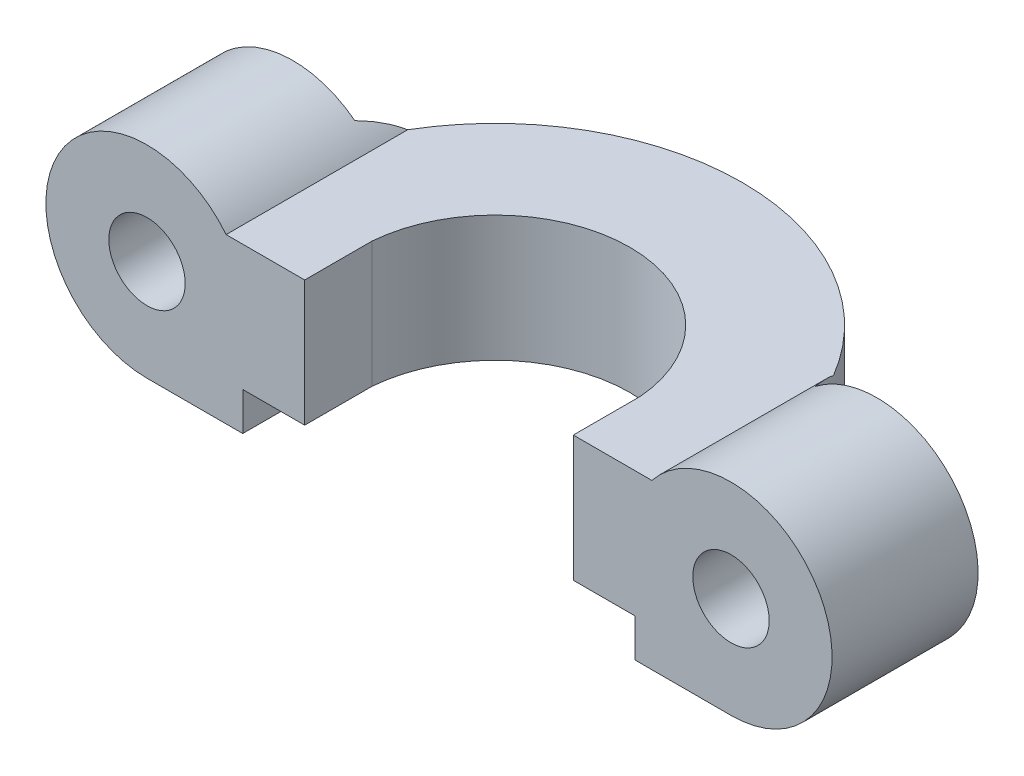
ISO-10303-21;
HEADER;
FILE_DESCRIPTION(('STEP AP214'),'2;1');
FILE_NAME('part.step','',(''),(''),'','','');
FILE_SCHEMA(('AUTOMOTIVE_DESIGN { 1 0 10303 214 1 1 1 1 }'));
ENDSEC;
DATA;
#1=APPLICATION_CONTEXT('core data for automotive mechanical design processes');
#2=APPLICATION_PROTOCOL_DEFINITION('international standard','automotive_design',2000,#1);
#3=PRODUCT_CONTEXT('',#1,'mechanical');
#4=PRODUCT('Part','Part','',(#3));
#5=PRODUCT_RELATED_PRODUCT_CATEGORY('part','',(#4));
#6=PRODUCT_DEFINITION_FORMATION('','',#4);
#7=PRODUCT_DEFINITION_CONTEXT('part definition',#1,'design');
#8=PRODUCT_DEFINITION('design','',#6,#7);
#9=PRODUCT_DEFINITION_SHAPE('','',#8);
#10=(LENGTH_UNIT() NAMED_UNIT(*) SI_UNIT(.MILLI.,.METRE.));
#11=(NAMED_UNIT(*) PLANE_ANGLE_UNIT() SI_UNIT($,.RADIAN.));
#12=(NAMED_UNIT(*) SI_UNIT($,.STERADIAN.) SOLID_ANGLE_UNIT());
#13=UNCERTAINTY_MEASURE_WITH_UNIT(LENGTH_MEASURE(1.E-05),#10,'distance_accuracy_value','');
#14=(GEOMETRIC_REPRESENTATION_CONTEXT(3) GLOBAL_UNCERTAINTY_ASSIGNED_CONTEXT((#13)) GLOBAL_UNIT_ASSIGNED_CONTEXT((#10,
#11,#12)) REPRESENTATION_CONTEXT('',''));
#15=CARTESIAN_POINT('',(0.,0.,0.));
#16=DIRECTION('',(0.,0.,1.));
#17=DIRECTION('',(1.,0.,0.));
#18=AXIS2_PLACEMENT_3D('',#15,#16,#17);
#19=CARTESIAN_POINT('',(0.,-7.5,-4.));
#20=DIRECTION('',(0.,0.,-1.));
#21=DIRECTION('',(-1.,0.,0.));
#22=AXIS2_PLACEMENT_3D('',#19,#20,#21);
#23=PLANE('',#22);
#24=CARTESIAN_POINT('',(-13.,0.,-4.));
#25=DIRECTION('',(0.,0.,-1.));
#26=DIRECTION('',(-1.,0.,0.));
#27=AXIS2_PLACEMENT_3D('',#24,#25,#26);
#28=CIRCLE('',#27,1.69999999999999);
#29=CARTESIAN_POINT('',(-14.7,0.,-4.));
#30=VERTEX_POINT('',#29);
#31=EDGE_CURVE('E276',#30,#30,#28,.F.);
#32=ORIENTED_EDGE('',*,*,#31,.T.);
#33=EDGE_LOOP('',(#32));
#34=FACE_BOUND('',#33,.T.);
#35=DIRECTION('',(0.,1.,0.));
#36=VECTOR('',#35,1.);
#37=CARTESIAN_POINT('',(-10.2469507659596,-7.5,-4.));
#38=LINE('',#37,#36);
#39=CARTESIAN_POINT('',(-10.2469507659596,-4.5,-4.));
#40=VERTEX_POINT('',#39);
#41=CARTESIAN_POINT('',(-10.2469507659596,3.559595470689,-4.));
#42=VERTEX_POINT('',#41);
#43=EDGE_CURVE('E279',#40,#42,#38,.T.);
#44=ORIENTED_EDGE('',*,*,#43,.F.);
#45=DIRECTION('',(-1.,0.,0.));
#46=VECTOR('',#45,1.);
#47=CARTESIAN_POINT('',(0.,-4.5,-4.));
#48=LINE('',#47,#46);
#49=CARTESIAN_POINT('',(-13.,-4.5,-4.));
#50=VERTEX_POINT('',#49);
#51=EDGE_CURVE('E46',#40,#50,#48,.T.);
#52=ORIENTED_EDGE('',*,*,#51,.T.);
#53=CARTESIAN_POINT('',(-13.,0.,-4.));
#54=DIRECTION('',(0.,0.,-1.));
#55=DIRECTION('',(-1.,0.,0.));
#56=AXIS2_PLACEMENT_3D('',#53,#54,#55);
#57=CIRCLE('',#56,4.5);
#58=EDGE_CURVE('E93',#50,#42,#57,.T.);
#59=ORIENTED_EDGE('',*,*,#58,.T.);
#60=EDGE_LOOP('',(#44,#52,#59));
#61=FACE_BOUND('',#60,.T.);
#62=ADVANCED_FACE('F42',(#34,#61),#23,.T.);
#63=CARTESIAN_POINT('',(13.,0.,-12.));
#64=DIRECTION('',(0.,0.,-1.));
#65=DIRECTION('',(-1.,0.,0.));
#66=AXIS2_PLACEMENT_3D('',#63,#64,#65);
#67=CYLINDRICAL_SURFACE('',#66,1.69999999999999);
#68=CARTESIAN_POINT('',(13.,0.,-4.));
#69=DIRECTION('',(0.,0.,-1.));
#70=DIRECTION('',(-1.,0.,0.));
#71=AXIS2_PLACEMENT_3D('',#68,#69,#70);
#72=CIRCLE('',#71,1.69999999999999);
#73=CARTESIAN_POINT('',(11.3,0.,-4.));
#74=VERTEX_POINT('',#73);
#75=EDGE_CURVE('E196',#74,#74,#72,.F.);
#76=ORIENTED_EDGE('',*,*,#75,.F.);
#77=EDGE_LOOP('',(#76));
#78=FACE_BOUND('',#77,.T.);
#79=CARTESIAN_POINT('',(13.,0.,2.5));
#80=DIRECTION('',(0.,0.,1.));
#81=DIRECTION('',(1.,0.,0.));
#82=AXIS2_PLACEMENT_3D('',#79,#80,#81);
#83=CIRCLE('',#82,1.7);
#84=CARTESIAN_POINT('',(14.7,0.,2.5));
#85=VERTEX_POINT('',#84);
#86=EDGE_CURVE('E409',#85,#85,#83,.T.);
#87=ORIENTED_EDGE('',*,*,#86,.T.);
#88=EDGE_LOOP('',(#87));
#89=FACE_BOUND('',#88,.T.);
#90=ADVANCED_FACE('F248',(#78,#89),#67,.F.);
#91=CARTESIAN_POINT('',(-13.,0.,-12.));
#92=DIRECTION('',(0.,0.,-1.));
#93=DIRECTION('',(-1.,0.,0.));
#94=AXIS2_PLACEMENT_3D('',#91,#92,#93);
#95=CYLINDRICAL_SURFACE('',#94,1.69999999999999);
#96=ORIENTED_EDGE('',*,*,#31,.F.);
#97=EDGE_LOOP('',(#96));
#98=FACE_BOUND('',#97,.T.);
#99=CARTESIAN_POINT('',(-13.,0.,2.5));
#100=DIRECTION('',(0.,0.,1.));
#101=DIRECTION('',(1.,0.,0.));
#102=AXIS2_PLACEMENT_3D('',#99,#100,#101);
#103=CIRCLE('',#102,1.7);
#104=CARTESIAN_POINT('',(-11.3,0.,2.5));
#105=VERTEX_POINT('',#104);
#106=EDGE_CURVE('E341',#105,#105,#103,.F.);
#107=ORIENTED_EDGE('',*,*,#106,.F.);
#108=EDGE_LOOP('',(#107));
#109=FACE_BOUND('',#108,.T.);
#110=ADVANCED_FACE('F253',(#98,#109),#95,.F.);
#111=CARTESIAN_POINT('',(8.75,2.8,0.));
#112=DIRECTION('',(0.,1.,0.));
#113=DIRECTION('',(0.,0.,1.));
#114=AXIS2_PLACEMENT_3D('',#111,#112,#113);
#115=PLANE('',#114);
#116=CARTESIAN_POINT('',(0.,2.8,0.));
#117=DIRECTION('',(0.,1.,0.));
#118=DIRECTION('',(0.,0.,1.));
#119=AXIS2_PLACEMENT_3D('',#116,#117,#118);
#120=CIRCLE('',#119,6.);
#121=CARTESIAN_POINT('',(5.9791303715507,2.8,-0.5));
#122=VERTEX_POINT('',#121);
#123=CARTESIAN_POINT('',(-5.9791303715507,2.8,-0.5));
#124=VERTEX_POINT('',#123);
#125=EDGE_CURVE('E129',#122,#124,#120,.T.);
#126=ORIENTED_EDGE('',*,*,#125,.F.);
#127=DIRECTION('',(0.,0.,-1.));
#128=VECTOR('',#127,1.);
#129=CARTESIAN_POINT('',(5.9791303715507,2.8,2.5));
#130=LINE('',#129,#128);
#131=CARTESIAN_POINT('',(5.9791303715507,2.8,2.5));
#132=VERTEX_POINT('',#131);
#133=EDGE_CURVE('E302',#132,#122,#130,.T.);
#134=ORIENTED_EDGE('',*,*,#133,.F.);
#135=DIRECTION('',(-1.,0.,0.));
#136=VECTOR('',#135,1.);
#137=CARTESIAN_POINT('',(0.,2.8,2.5));
#138=LINE('',#137,#136);
#139=CARTESIAN_POINT('',(9.47721700923829,2.8,2.5));
#140=VERTEX_POINT('',#139);
#141=EDGE_CURVE('E300',#140,#132,#138,.T.);
#142=ORIENTED_EDGE('',*,*,#141,.F.);
#143=DIRECTION('',(0.,0.,1.));
#144=VECTOR('',#143,1.);
#145=CARTESIAN_POINT('',(9.47721700923829,2.8,-11.));
#146=LINE('',#145,#144);
#147=CARTESIAN_POINT('',(9.47721700923829,2.8,-5.58411656037054));
#148=VERTEX_POINT('',#147);
#149=EDGE_CURVE('E183',#148,#140,#146,.T.);
#150=ORIENTED_EDGE('',*,*,#149,.F.);
#151=CARTESIAN_POINT('',(0.,2.8,0.));
#152=DIRECTION('',(0.,-1.,0.));
#153=DIRECTION('',(0.,0.,-1.));
#154=AXIS2_PLACEMENT_3D('',#151,#152,#153);
#155=CIRCLE('',#154,11.);
#156=CARTESIAN_POINT('',(-9.47721700923828,2.8,-5.58411656037054));
#157=VERTEX_POINT('',#156);
#158=EDGE_CURVE('E103',#148,#157,#155,.F.);
#159=ORIENTED_EDGE('',*,*,#158,.T.);
#160=DIRECTION('',(0.,0.,1.));
#161=VECTOR('',#160,1.);
#162=CARTESIAN_POINT('',(-9.47721700923828,2.8,-11.));
#163=LINE('',#162,#161);
#164=CARTESIAN_POINT('',(-9.47721700923828,2.8,2.5));
#165=VERTEX_POINT('',#164);
#166=EDGE_CURVE('E180',#157,#165,#163,.T.);
#167=ORIENTED_EDGE('',*,*,#166,.T.);
#168=DIRECTION('',(-1.,0.,0.));
#169=VECTOR('',#168,1.);
#170=CARTESIAN_POINT('',(0.,2.8,2.5));
#171=LINE('',#170,#169);
#172=CARTESIAN_POINT('',(-5.9791303715507,2.8,2.5));
#173=VERTEX_POINT('',#172);
#174=EDGE_CURVE('E158',#173,#165,#171,.T.);
#175=ORIENTED_EDGE('',*,*,#174,.F.);
#176=DIRECTION('',(0.,0.,-1.));
#177=VECTOR('',#176,1.);
#178=CARTESIAN_POINT('',(-5.9791303715507,2.8,2.5));
#179=LINE('',#178,#177);
#180=EDGE_CURVE('E149',#173,#124,#179,.T.);
#181=ORIENTED_EDGE('',*,*,#180,.T.);
#182=EDGE_LOOP('',(#126,#134,#142,#150,#159,#167,#175,#181));
#183=FACE_BOUND('',#182,.T.);
#184=ADVANCED_FACE('F156',(#183),#115,.T.);
#185=CARTESIAN_POINT('',(0.,7.5,0.));
#186=DIRECTION('',(0.,1.,0.));
#187=DIRECTION('',(0.,0.,1.));
#188=AXIS2_PLACEMENT_3D('',#185,#186,#187);
#189=CYLINDRICAL_SURFACE('',#188,6.);
#190=DIRECTION('',(0.,1.,0.));
#191=VECTOR('',#190,1.);
#192=CARTESIAN_POINT('',(-5.9791303715507,7.5,-0.5));
#193=LINE('',#192,#191);
#194=CARTESIAN_POINT('',(-5.9791303715507,-2.8,-0.5));
#195=VERTEX_POINT('',#194);
#196=EDGE_CURVE('E132',#195,#124,#193,.T.);
#197=ORIENTED_EDGE('',*,*,#196,.F.);
#198=CARTESIAN_POINT('',(0.,-2.8,0.));
#199=DIRECTION('',(0.,1.,0.));
#200=DIRECTION('',(0.,0.,1.));
#201=AXIS2_PLACEMENT_3D('',#198,#199,#200);
#202=CIRCLE('',#201,6.);
#203=CARTESIAN_POINT('',(5.9791303715507,-2.8,-0.5));
#204=VERTEX_POINT('',#203);
#205=EDGE_CURVE('E141',#204,#195,#202,.T.);
#206=ORIENTED_EDGE('',*,*,#205,.F.);
#207=DIRECTION('',(0.,1.,0.));
#208=VECTOR('',#207,1.);
#209=CARTESIAN_POINT('',(5.9791303715507,7.5,-0.5));
#210=LINE('',#209,#208);
#211=EDGE_CURVE('E135',#122,#204,#210,.F.);
#212=ORIENTED_EDGE('',*,*,#211,.F.);
#213=ORIENTED_EDGE('',*,*,#125,.T.);
#214=EDGE_LOOP('',(#197,#206,#212,#213));
#215=FACE_BOUND('',#214,.T.);
#216=ADVANCED_FACE('F131',(#215),#189,.F.);
#217=CARTESIAN_POINT('',(6.,-2.8,0.));
#218=DIRECTION('',(0.,-1.,0.));
#219=DIRECTION('',(0.,0.,-1.));
#220=AXIS2_PLACEMENT_3D('',#217,#218,#219);
#221=PLANE('',#220);
#222=ORIENTED_EDGE('',*,*,#205,.T.);
#223=DIRECTION('',(0.,0.,-1.));
#224=VECTOR('',#223,1.);
#225=CARTESIAN_POINT('',(-5.9791303715507,-2.8,2.5));
#226=LINE('',#225,#224);
#227=CARTESIAN_POINT('',(-5.9791303715507,-2.8,2.5));
#228=VERTEX_POINT('',#227);
#229=EDGE_CURVE('E152',#228,#195,#226,.T.);
#230=ORIENTED_EDGE('',*,*,#229,.F.);
#231=DIRECTION('',(1.,0.,0.));
#232=VECTOR('',#231,1.);
#233=CARTESIAN_POINT('',(0.,-2.8,2.5));
#234=LINE('',#233,#232);
#235=CARTESIAN_POINT('',(-8.73570260482807,-2.8,2.5));
#236=VERTEX_POINT('',#235);
#237=EDGE_CURVE('E357',#236,#228,#234,.T.);
#238=ORIENTED_EDGE('',*,*,#237,.F.);
#239=DIRECTION('',(0.,0.,-1.));
#240=VECTOR('',#239,1.);
#241=CARTESIAN_POINT('',(-8.73570260482807,-2.8,2.5));
#242=LINE('',#241,#240);
#243=CARTESIAN_POINT('',(-8.73570260482807,-2.8,-0.5));
#244=VERTEX_POINT('',#243);
#245=EDGE_CURVE('E163',#236,#244,#242,.T.);
#246=ORIENTED_EDGE('',*,*,#245,.T.);
#247=CARTESIAN_POINT('',(0.,-2.8,0.));
#248=DIRECTION('',(0.,1.,0.));
#249=DIRECTION('',(0.,0.,1.));
#250=AXIS2_PLACEMENT_3D('',#247,#248,#249);
#251=CIRCLE('',#250,8.75);
#252=CARTESIAN_POINT('',(8.73570260482807,-2.8,-0.5));
#253=VERTEX_POINT('',#252);
#254=EDGE_CURVE('E154',#253,#244,#251,.T.);
#255=ORIENTED_EDGE('',*,*,#254,.F.);
#256=DIRECTION('',(0.,0.,-1.));
#257=VECTOR('',#256,1.);
#258=CARTESIAN_POINT('',(8.73570260482807,-2.8,2.5));
#259=LINE('',#258,#257);
#260=CARTESIAN_POINT('',(8.73570260482807,-2.8,2.5));
#261=VERTEX_POINT('',#260);
#262=EDGE_CURVE('E332',#261,#253,#259,.T.);
#263=ORIENTED_EDGE('',*,*,#262,.F.);
#264=DIRECTION('',(1.,0.,0.));
#265=VECTOR('',#264,1.);
#266=CARTESIAN_POINT('',(0.,-2.8,2.5));
#267=LINE('',#266,#265);
#268=CARTESIAN_POINT('',(5.9791303715507,-2.8,2.5));
#269=VERTEX_POINT('',#268);
#270=EDGE_CURVE('E316',#269,#261,#267,.T.);
#271=ORIENTED_EDGE('',*,*,#270,.F.);
#272=DIRECTION('',(0.,0.,-1.));
#273=VECTOR('',#272,1.);
#274=CARTESIAN_POINT('',(5.9791303715507,-2.8,2.5));
#275=LINE('',#274,#273);
#276=EDGE_CURVE('E336',#269,#204,#275,.T.);
#277=ORIENTED_EDGE('',*,*,#276,.T.);
#278=EDGE_LOOP('',(#222,#230,#238,#246,#255,#263,#271,#277));
#279=FACE_BOUND('',#278,.T.);
#280=ADVANCED_FACE('F266',(#279),#221,.T.);
#281=CARTESIAN_POINT('',(0.,7.5,0.));
#282=DIRECTION('',(0.,1.,0.));
#283=DIRECTION('',(0.,0.,1.));
#284=AXIS2_PLACEMENT_3D('',#281,#282,#283);
#285=CYLINDRICAL_SURFACE('',#284,8.75);
#286=DIRECTION('',(0.,1.,0.));
#287=VECTOR('',#286,1.);
#288=CARTESIAN_POINT('',(-8.73570260482807,7.5,-0.5));
#289=LINE('',#288,#287);
#290=CARTESIAN_POINT('',(-8.73570260482807,-4.5,-0.5));
#291=VERTEX_POINT('',#290);
#292=EDGE_CURVE('E205',#291,#244,#289,.T.);
#293=ORIENTED_EDGE('',*,*,#292,.F.);
#294=CARTESIAN_POINT('',(0.,-4.5,0.));
#295=DIRECTION('',(0.,-1.,0.));
#296=DIRECTION('',(1.,0.,0.));
#297=AXIS2_PLACEMENT_3D('',#294,#295,#296);
#298=CIRCLE('',#297,8.75);
#299=CARTESIAN_POINT('',(8.73570260482807,-4.5,-0.5));
#300=VERTEX_POINT('',#299);
#301=EDGE_CURVE('E190',#291,#300,#298,.T.);
#302=ORIENTED_EDGE('',*,*,#301,.T.);
#303=DIRECTION('',(0.,1.,0.));
#304=VECTOR('',#303,1.);
#305=CARTESIAN_POINT('',(8.73570260482807,7.5,-0.5));
#306=LINE('',#305,#304);
#307=EDGE_CURVE('E140',#253,#300,#306,.F.);
#308=ORIENTED_EDGE('',*,*,#307,.F.);
#309=ORIENTED_EDGE('',*,*,#254,.T.);
#310=EDGE_LOOP('',(#293,#302,#308,#309));
#311=FACE_BOUND('',#310,.T.);
#312=ADVANCED_FACE('F259',(#311),#285,.F.);
#313=CARTESIAN_POINT('',(13.,0.,-4.));
#314=DIRECTION('',(0.,0.,-1.));
#315=DIRECTION('',(-1.,0.,0.));
#316=AXIS2_PLACEMENT_3D('',#313,#314,#315);
#317=CIRCLE('',#316,4.5);
#318=CARTESIAN_POINT('',(10.2469507659596,3.55959547068899,-4.));
#319=VERTEX_POINT('',#318);
#320=CARTESIAN_POINT('',(13.,-4.5,-4.));
#321=VERTEX_POINT('',#320);
#322=EDGE_CURVE('E65',#319,#321,#317,.T.);
#323=ORIENTED_EDGE('',*,*,#322,.T.);
#324=DIRECTION('',(-1.,0.,0.));
#325=VECTOR('',#324,1.);
#326=CARTESIAN_POINT('',(0.,-4.5,-4.));
#327=LINE('',#326,#325);
#328=CARTESIAN_POINT('',(10.2469507659596,-4.5,-4.));
#329=VERTEX_POINT('',#328);
#330=EDGE_CURVE('E194',#321,#329,#327,.T.);
#331=ORIENTED_EDGE('',*,*,#330,.T.);
#332=DIRECTION('',(0.,1.,0.));
#333=VECTOR('',#332,1.);
#334=CARTESIAN_POINT('',(10.2469507659596,-7.5,-4.));
#335=LINE('',#334,#333);
#336=EDGE_CURVE('E193',#329,#319,#335,.T.);
#337=ORIENTED_EDGE('',*,*,#336,.T.);
#338=EDGE_LOOP('',(#323,#331,#337));
#339=FACE_BOUND('',#338,.T.);
#340=ORIENTED_EDGE('',*,*,#75,.T.);
#341=EDGE_LOOP('',(#340));
#342=FACE_BOUND('',#341,.T.);
#343=ADVANCED_FACE('F44',(#339,#342),#23,.T.);
#344=CARTESIAN_POINT('',(0.,-7.5,0.));
#345=DIRECTION('',(0.,1.,0.));
#346=DIRECTION('',(0.,0.,1.));
#347=AXIS2_PLACEMENT_3D('',#344,#345,#346);
#348=CYLINDRICAL_SURFACE('',#347,11.);
#349=ORIENTED_EDGE('',*,*,#336,.F.);
#350=CARTESIAN_POINT('',(0.,-4.5,0.));
#351=DIRECTION('',(0.,-1.,0.));
#352=DIRECTION('',(1.,0.,0.));
#353=AXIS2_PLACEMENT_3D('',#350,#351,#352);
#354=CIRCLE('',#353,11.);
#355=EDGE_CURVE('E211',#329,#40,#354,.F.);
#356=ORIENTED_EDGE('',*,*,#355,.T.);
#357=ORIENTED_EDGE('',*,*,#43,.T.);
#358=CARTESIAN_POINT('',(-10.5617662827161,3.78219728992288,-3.07393770094345));
#359=CARTESIAN_POINT('',(-10.5366622563989,3.76601052374307,-3.1601953364395));
#360=CARTESIAN_POINT('',(-10.5105515494036,3.74882770779455,-3.24596730602628));
#361=CARTESIAN_POINT('',(-10.4563822908167,3.71228782761463,-3.4164410678354));
#362=CARTESIAN_POINT('',(-10.4283234303694,3.69293041832637,-3.50114268783953));
#363=CARTESIAN_POINT('',(-10.3412066657185,3.63123998536348,-3.75382615640703));
#364=CARTESIAN_POINT('',(-10.2793206433472,3.58535901089947,-3.92000260869834));
#365=CARTESIAN_POINT('',(-10.1502616316303,3.48361894845402,-4.2428511280858));
#366=CARTESIAN_POINT('',(-10.0832249274139,3.42798656227321,-4.39964884015378));
#367=CARTESIAN_POINT('',(-9.94402700068483,3.30449295812343,-4.70579899715934));
#368=CARTESIAN_POINT('',(-9.87187236482011,3.23664729131123,-4.85516060526572));
#369=CARTESIAN_POINT('',(-9.7459170975512,3.10908818239977,-5.10198034610971));
#370=CARTESIAN_POINT('',(-9.69300332612779,3.05290900208986,-5.20171882126432));
#371=CARTESIAN_POINT('',(-9.5858313074135,2.93256808369939,-5.39670262683938));
#372=CARTESIAN_POINT('',(-9.53156609435191,2.86835142995031,-5.49191014356432));
#373=CARTESIAN_POINT('',(-9.47721700923828,2.8,-5.58411656037054));
#374=B_SPLINE_CURVE_WITH_KNOTS('',3,(#358,#359,#360,#361,#362,#363,#364,#365,#366,#367,#368,
#369,#370,#371,#372,#373),.UNSPECIFIED.,.F.,.F.,(4,2,2,2,2,2,2,4),(0.,0.273823856229884,
0.5476912234076,1.09664176772904,1.63420614745787,2.17109082722408,2.54910735763011,
2.92986424645855),.UNSPECIFIED.);
#375=EDGE_CURVE('E12',#42,#157,#374,.T.);
#376=ORIENTED_EDGE('',*,*,#375,.T.);
#377=ORIENTED_EDGE('',*,*,#158,.F.);
#378=CARTESIAN_POINT('',(9.47721700923829,2.8,-5.58411656037053));
#379=CARTESIAN_POINT('',(9.53157140006027,2.86835848905406,-5.49190027027853));
#380=CARTESIAN_POINT('',(9.58584152478294,2.93258037524479,-5.39668427494642));
#381=CARTESIAN_POINT('',(9.69301311555799,3.05291917828455,-5.20170078028436));
#382=CARTESIAN_POINT('',(9.74592172780747,3.10909242821736,-5.10197207043394));
#383=CARTESIAN_POINT('',(9.87598150221678,3.24080941690325,-4.84710721539548));
#384=CARTESIAN_POINT('',(9.95204512740257,3.31201863956554,-4.68917117969859));
#385=CARTESIAN_POINT('',(10.0983913345798,3.44095801800672,-4.3651094575224));
#386=CARTESIAN_POINT('',(10.1686653931987,3.49866852289378,-4.1989722526717));
#387=CARTESIAN_POINT('',(10.3035271769959,3.60367960050592,-3.85642026051794));
#388=CARTESIAN_POINT('',(10.3679470026902,3.65071030552759,-3.67985699348013));
#389=CARTESIAN_POINT('',(10.458083084862,3.71348702384038,-3.41136331944781));
#390=CARTESIAN_POINT('',(10.4870134982937,3.73309769004335,-3.32137400605529));
#391=CARTESIAN_POINT('',(10.5426646178296,3.76996171080124,-3.14025414270005));
#392=CARTESIAN_POINT('',(10.5693857174708,3.78721548553926,-3.04912379932922));
#393=CARTESIAN_POINT('',(10.5949666619247,3.80339514680642,-2.95747889809991));
#394=B_SPLINE_CURVE_WITH_KNOTS('',3,(#378,#379,#380,#381,#382,#383,#384,#385,#386,#387,#388,
#389,#390,#391,#392,#393),.UNSPECIFIED.,.F.,.F.,(4,2,2,2,2,2,2,4),(0.,0.380792262901275,
0.75877341608111,1.32550301950843,1.89305258060165,2.4736518893889,2.76321625377362,
3.05272892749235),.UNSPECIFIED.);
#395=EDGE_CURVE('E53',#148,#319,#394,.T.);
#396=ORIENTED_EDGE('',*,*,#395,.T.);
#397=EDGE_LOOP('',(#349,#356,#357,#376,#377,#396));
#398=FACE_BOUND('',#397,.T.);
#399=ADVANCED_FACE('F228',(#398),#348,.T.);
#400=CARTESIAN_POINT('',(-13.,0.,-11.));
#401=DIRECTION('',(0.,0.,1.));
#402=DIRECTION('',(1.,0.,0.));
#403=AXIS2_PLACEMENT_3D('',#400,#401,#402);
#404=CYLINDRICAL_SURFACE('',#403,4.5);
#405=ORIENTED_EDGE('',*,*,#375,.F.);
#406=ORIENTED_EDGE('',*,*,#58,.F.);
#407=DIRECTION('',(0.,0.,1.));
#408=VECTOR('',#407,1.);
#409=CARTESIAN_POINT('',(-13.,-4.5,-11.));
#410=LINE('',#409,#408);
#411=CARTESIAN_POINT('',(-13.,-4.5,2.5));
#412=VERTEX_POINT('',#411);
#413=EDGE_CURVE('E177',#50,#412,#410,.T.);
#414=ORIENTED_EDGE('',*,*,#413,.T.);
#415=CARTESIAN_POINT('',(-13.,0.,2.5));
#416=DIRECTION('',(0.,0.,1.));
#417=DIRECTION('',(1.,0.,0.));
#418=AXIS2_PLACEMENT_3D('',#415,#416,#417);
#419=CIRCLE('',#418,4.5);
#420=EDGE_CURVE('E345',#165,#412,#419,.T.);
#421=ORIENTED_EDGE('',*,*,#420,.F.);
#422=ORIENTED_EDGE('',*,*,#166,.F.);
#423=EDGE_LOOP('',(#405,#406,#414,#421,#422));
#424=FACE_BOUND('',#423,.T.);
#425=ADVANCED_FACE('F236',(#424),#404,.T.);
#426=CARTESIAN_POINT('',(13.,0.,-11.));
#427=DIRECTION('',(0.,0.,1.));
#428=DIRECTION('',(1.,0.,0.));
#429=AXIS2_PLACEMENT_3D('',#426,#427,#428);
#430=CYLINDRICAL_SURFACE('',#429,4.5);
#431=DIRECTION('',(0.,0.,1.));
#432=VECTOR('',#431,1.);
#433=CARTESIAN_POINT('',(13.,-4.5,-11.));
#434=LINE('',#433,#432);
#435=CARTESIAN_POINT('',(13.,-4.5,2.5));
#436=VERTEX_POINT('',#435);
#437=EDGE_CURVE('E176',#321,#436,#434,.T.);
#438=ORIENTED_EDGE('',*,*,#437,.F.);
#439=ORIENTED_EDGE('',*,*,#322,.F.);
#440=ORIENTED_EDGE('',*,*,#395,.F.);
#441=ORIENTED_EDGE('',*,*,#149,.T.);
#442=CARTESIAN_POINT('',(13.,0.,2.5));
#443=DIRECTION('',(0.,0.,1.));
#444=DIRECTION('',(1.,0.,0.));
#445=AXIS2_PLACEMENT_3D('',#442,#443,#444);
#446=CIRCLE('',#445,4.5);
#447=EDGE_CURVE('E311',#436,#140,#446,.T.);
#448=ORIENTED_EDGE('',*,*,#447,.F.);
#449=EDGE_LOOP('',(#438,#439,#440,#441,#448));
#450=FACE_BOUND('',#449,.T.);
#451=ADVANCED_FACE('F232',(#450),#430,.T.);
#452=CARTESIAN_POINT('',(0.,-4.5,-11.));
#453=DIRECTION('',(0.,-1.,0.));
#454=DIRECTION('',(1.,0.,0.));
#455=AXIS2_PLACEMENT_3D('',#452,#453,#454);
#456=PLANE('',#455);
#457=ORIENTED_EDGE('',*,*,#301,.F.);
#458=DIRECTION('',(0.,0.,-1.));
#459=VECTOR('',#458,1.);
#460=CARTESIAN_POINT('',(-8.73570260482807,-4.5,2.5));
#461=LINE('',#460,#459);
#462=CARTESIAN_POINT('',(-8.73570260482807,-4.5,2.5));
#463=VERTEX_POINT('',#462);
#464=EDGE_CURVE('E173',#463,#291,#461,.T.);
#465=ORIENTED_EDGE('',*,*,#464,.F.);
#466=DIRECTION('',(1.,0.,0.));
#467=VECTOR('',#466,1.);
#468=CARTESIAN_POINT('',(0.,-4.5,2.5));
#469=LINE('',#468,#467);
#470=EDGE_CURVE('E349',#412,#463,#469,.T.);
#471=ORIENTED_EDGE('',*,*,#470,.F.);
#472=ORIENTED_EDGE('',*,*,#413,.F.);
#473=ORIENTED_EDGE('',*,*,#51,.F.);
#474=ORIENTED_EDGE('',*,*,#355,.F.);
#475=ORIENTED_EDGE('',*,*,#330,.F.);
#476=ORIENTED_EDGE('',*,*,#437,.T.);
#477=DIRECTION('',(1.,0.,0.));
#478=VECTOR('',#477,1.);
#479=CARTESIAN_POINT('',(0.,-4.5,2.5));
#480=LINE('',#479,#478);
#481=CARTESIAN_POINT('',(8.73570260482807,-4.5,2.5));
#482=VERTEX_POINT('',#481);
#483=EDGE_CURVE('E318',#482,#436,#480,.T.);
#484=ORIENTED_EDGE('',*,*,#483,.F.);
#485=DIRECTION('',(0.,0.,-1.));
#486=VECTOR('',#485,1.);
#487=CARTESIAN_POINT('',(8.73570260482807,-4.5,2.5));
#488=LINE('',#487,#486);
#489=EDGE_CURVE('E328',#482,#300,#488,.T.);
#490=ORIENTED_EDGE('',*,*,#489,.T.);
#491=EDGE_LOOP('',(#457,#465,#471,#472,#473,#474,#475,#476,#484,#490));
#492=FACE_BOUND('',#491,.T.);
#493=ADVANCED_FACE('F235',(#492),#456,.T.);
#494=CARTESIAN_POINT('',(-8.73570260482807,0.,2.5));
#495=DIRECTION('',(-1.,0.,0.));
#496=DIRECTION('',(0.,0.,1.));
#497=AXIS2_PLACEMENT_3D('',#494,#495,#496);
#498=PLANE('',#497);
#499=ORIENTED_EDGE('',*,*,#292,.T.);
#500=ORIENTED_EDGE('',*,*,#245,.F.);
#501=DIRECTION('',(0.,1.,0.));
#502=VECTOR('',#501,1.);
#503=CARTESIAN_POINT('',(-8.73570260482807,0.,2.5));
#504=LINE('',#503,#502);
#505=EDGE_CURVE('E353',#463,#236,#504,.T.);
#506=ORIENTED_EDGE('',*,*,#505,.F.);
#507=ORIENTED_EDGE('',*,*,#464,.T.);
#508=EDGE_LOOP('',(#499,#500,#506,#507));
#509=FACE_BOUND('',#508,.T.);
#510=ADVANCED_FACE('F240',(#509),#498,.F.);
#511=CARTESIAN_POINT('',(-5.9791303715507,0.,2.5));
#512=DIRECTION('',(-1.,0.,0.));
#513=DIRECTION('',(0.,0.,1.));
#514=AXIS2_PLACEMENT_3D('',#511,#512,#513);
#515=PLANE('',#514);
#516=ORIENTED_EDGE('',*,*,#196,.T.);
#517=ORIENTED_EDGE('',*,*,#180,.F.);
#518=DIRECTION('',(0.,1.,0.));
#519=VECTOR('',#518,1.);
#520=CARTESIAN_POINT('',(-5.9791303715507,0.,2.5));
#521=LINE('',#520,#519);
#522=EDGE_CURVE('E166',#228,#173,#521,.T.);
#523=ORIENTED_EDGE('',*,*,#522,.F.);
#524=ORIENTED_EDGE('',*,*,#229,.T.);
#525=EDGE_LOOP('',(#516,#517,#523,#524));
#526=FACE_BOUND('',#525,.T.);
#527=ADVANCED_FACE('F146',(#526),#515,.F.);
#528=CARTESIAN_POINT('',(0.,0.,2.5));
#529=DIRECTION('',(0.,0.,1.));
#530=DIRECTION('',(1.,0.,0.));
#531=AXIS2_PLACEMENT_3D('',#528,#529,#530);
#532=PLANE('',#531);
#533=ORIENTED_EDGE('',*,*,#106,.T.);
#534=EDGE_LOOP('',(#533));
#535=FACE_BOUND('',#534,.T.);
#536=ORIENTED_EDGE('',*,*,#420,.T.);
#537=ORIENTED_EDGE('',*,*,#470,.T.);
#538=ORIENTED_EDGE('',*,*,#505,.T.);
#539=ORIENTED_EDGE('',*,*,#237,.T.);
#540=ORIENTED_EDGE('',*,*,#522,.T.);
#541=ORIENTED_EDGE('',*,*,#174,.T.);
#542=EDGE_LOOP('',(#536,#537,#538,#539,#540,#541));
#543=FACE_BOUND('',#542,.T.);
#544=ADVANCED_FACE('F362',(#535,#543),#532,.T.);
#545=CARTESIAN_POINT('',(5.9791303715507,0.,2.5));
#546=DIRECTION('',(1.,0.,0.));
#547=DIRECTION('',(0.,0.,-1.));
#548=AXIS2_PLACEMENT_3D('',#545,#546,#547);
#549=PLANE('',#548);
#550=ORIENTED_EDGE('',*,*,#211,.T.);
#551=ORIENTED_EDGE('',*,*,#276,.F.);
#552=DIRECTION('',(0.,-1.,0.));
#553=VECTOR('',#552,1.);
#554=CARTESIAN_POINT('',(5.9791303715507,0.,2.5));
#555=LINE('',#554,#553);
#556=EDGE_CURVE('E310',#132,#269,#555,.T.);
#557=ORIENTED_EDGE('',*,*,#556,.F.);
#558=ORIENTED_EDGE('',*,*,#133,.T.);
#559=EDGE_LOOP('',(#550,#551,#557,#558));
#560=FACE_BOUND('',#559,.T.);
#561=ADVANCED_FACE('F401',(#560),#549,.F.);
#562=CARTESIAN_POINT('',(8.73570260482807,0.,2.5));
#563=DIRECTION('',(1.,0.,0.));
#564=DIRECTION('',(0.,0.,-1.));
#565=AXIS2_PLACEMENT_3D('',#562,#563,#564);
#566=PLANE('',#565);
#567=ORIENTED_EDGE('',*,*,#307,.T.);
#568=ORIENTED_EDGE('',*,*,#489,.F.);
#569=DIRECTION('',(0.,-1.,0.));
#570=VECTOR('',#569,1.);
#571=CARTESIAN_POINT('',(8.73570260482807,0.,2.5));
#572=LINE('',#571,#570);
#573=EDGE_CURVE('E325',#261,#482,#572,.T.);
#574=ORIENTED_EDGE('',*,*,#573,.F.);
#575=ORIENTED_EDGE('',*,*,#262,.T.);
#576=EDGE_LOOP('',(#567,#568,#574,#575));
#577=FACE_BOUND('',#576,.T.);
#578=ADVANCED_FACE('F417',(#577),#566,.F.);
#579=CARTESIAN_POINT('',(0.,0.,2.5));
#580=DIRECTION('',(0.,0.,1.));
#581=DIRECTION('',(1.,0.,0.));
#582=AXIS2_PLACEMENT_3D('',#579,#580,#581);
#583=PLANE('',#582);
#584=ORIENTED_EDGE('',*,*,#86,.F.);
#585=EDGE_LOOP('',(#584));
#586=FACE_BOUND('',#585,.T.);
#587=ORIENTED_EDGE('',*,*,#483,.T.);
#588=ORIENTED_EDGE('',*,*,#447,.T.);
#589=ORIENTED_EDGE('',*,*,#141,.T.);
#590=ORIENTED_EDGE('',*,*,#556,.T.);
#591=ORIENTED_EDGE('',*,*,#270,.T.);
#592=ORIENTED_EDGE('',*,*,#573,.T.);
#593=EDGE_LOOP('',(#587,#588,#589,#590,#591,#592));
#594=FACE_BOUND('',#593,.T.);
#595=ADVANCED_FACE('F403',(#586,#594),#583,.T.);
#596=CLOSED_SHELL('',(#62,#90,#110,#184,#216,#280,#312,#343,#399,#425,#451,#493,#510,#527,#544,
#561,#578,#595));
#597=MANIFOLD_SOLID_BREP('B2',#596);
#598=ADVANCED_BREP_SHAPE_REPRESENTATION('',(#18,#597),#14);
#599=SHAPE_DEFINITION_REPRESENTATION(#9,#598);
ENDSEC;
END-ISO-10303-21;
